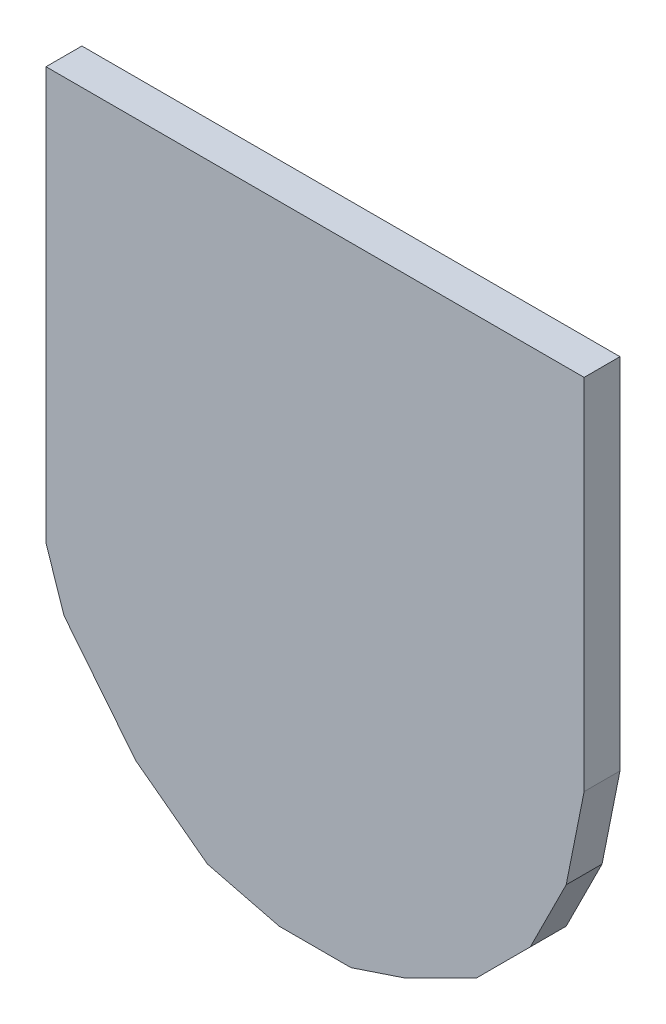
ISO-10303-21;
HEADER;
FILE_DESCRIPTION(('STEP AP214'),'2;1');
FILE_NAME('part.step','',(''),(''),'','','');
FILE_SCHEMA(('AUTOMOTIVE_DESIGN { 1 0 10303 214 1 1 1 1 }'));
ENDSEC;
DATA;
#1=APPLICATION_CONTEXT('core data for automotive mechanical design processes');
#2=APPLICATION_PROTOCOL_DEFINITION('international standard','automotive_design',2000,#1);
#3=PRODUCT_CONTEXT('',#1,'mechanical');
#4=PRODUCT('Part','Part','',(#3));
#5=PRODUCT_RELATED_PRODUCT_CATEGORY('part','',(#4));
#6=PRODUCT_DEFINITION_FORMATION('','',#4);
#7=PRODUCT_DEFINITION_CONTEXT('part definition',#1,'design');
#8=PRODUCT_DEFINITION('design','',#6,#7);
#9=PRODUCT_DEFINITION_SHAPE('','',#8);
#10=(LENGTH_UNIT() NAMED_UNIT(*) SI_UNIT(.MILLI.,.METRE.));
#11=(NAMED_UNIT(*) PLANE_ANGLE_UNIT() SI_UNIT($,.RADIAN.));
#12=(NAMED_UNIT(*) SI_UNIT($,.STERADIAN.) SOLID_ANGLE_UNIT());
#13=UNCERTAINTY_MEASURE_WITH_UNIT(LENGTH_MEASURE(1.E-05),#10,'distance_accuracy_value','');
#14=(GEOMETRIC_REPRESENTATION_CONTEXT(3) GLOBAL_UNCERTAINTY_ASSIGNED_CONTEXT((#13)) GLOBAL_UNIT_ASSIGNED_CONTEXT((#10,
#11,#12)) REPRESENTATION_CONTEXT('',''));
#15=CARTESIAN_POINT('',(0.,0.,0.));
#16=DIRECTION('',(0.,0.,1.));
#17=DIRECTION('',(1.,0.,0.));
#18=AXIS2_PLACEMENT_3D('',#15,#16,#17);
#19=CARTESIAN_POINT('',(0.1499997,0.17500092,0.02));
#20=DIRECTION('',(0.,0.,1.));
#21=DIRECTION('',(1.,0.,0.));
#22=AXIS2_PLACEMENT_3D('',#19,#20,#21);
#23=PLANE('',#22);
#24=DIRECTION('',(0.196068236745948,0.98059025415274,0.));
#25=VECTOR('',#24,1.);
#26=CARTESIAN_POINT('',(0.1499997,-0.02499868,0.02));
#27=LINE('',#26,#25);
#28=CARTESIAN_POINT('',(0.1499997,-0.0249986800000003,0.02));
#29=VERTEX_POINT('',#28);
#30=CARTESIAN_POINT('',(0.140002260000001,-0.0749985800000001,0.02));
#31=VERTEX_POINT('',#30);
#32=EDGE_CURVE('E218',#29,#31,#27,.F.);
#33=ORIENTED_EDGE('',*,*,#32,.F.);
#34=DIRECTION('',(0.,1.,0.));
#35=VECTOR('',#34,1.);
#36=CARTESIAN_POINT('',(0.1499997,0.17500092,0.02));
#37=LINE('',#36,#35);
#38=CARTESIAN_POINT('',(0.1499997,0.17500092,0.02));
#39=VERTEX_POINT('',#38);
#40=EDGE_CURVE('E156',#39,#29,#37,.F.);
#41=ORIENTED_EDGE('',*,*,#40,.F.);
#42=DIRECTION('',(1.,0.,0.));
#43=VECTOR('',#42,1.);
#44=CARTESIAN_POINT('',(-0.1499997,0.17500092,0.02));
#45=LINE('',#44,#43);
#46=CARTESIAN_POINT('',(-0.1499997,0.17500092,0.02));
#47=VERTEX_POINT('',#46);
#48=EDGE_CURVE('E132',#47,#39,#45,.T.);
#49=ORIENTED_EDGE('',*,*,#48,.F.);
#50=DIRECTION('',(0.,1.,0.));
#51=VECTOR('',#50,1.);
#52=CARTESIAN_POINT('',(-0.1499997,-0.02499868,0.02));
#53=LINE('',#52,#51);
#54=CARTESIAN_POINT('',(-0.149999699999994,-0.0249986800952127,0.02));
#55=VERTEX_POINT('',#54);
#56=EDGE_CURVE('E129',#55,#47,#53,.T.);
#57=ORIENTED_EDGE('',*,*,#56,.F.);
#58=DIRECTION('',(8.466683559677E-05,-0.999999996415764,0.));
#59=VECTOR('',#58,1.);
#60=CARTESIAN_POINT('',(-0.14999716,-0.05499861999999,0.02));
#61=LINE('',#60,#59);
#62=CARTESIAN_POINT('',(-0.149997160000005,-0.0549986200000074,0.02));
#63=VERTEX_POINT('',#62);
#64=EDGE_CURVE('E20',#63,#55,#61,.F.);
#65=ORIENTED_EDGE('',*,*,#64,.F.);
#66=DIRECTION('',(0.316227766017138,-0.948683298050414,0.));
#67=VECTOR('',#66,1.);
#68=CARTESIAN_POINT('',(-0.13999718,-0.08499855999999,0.02));
#69=LINE('',#68,#67);
#70=CARTESIAN_POINT('',(-0.139997180000001,-0.0849985599999537,0.02));
#71=VERTEX_POINT('',#70);
#72=EDGE_CURVE('E114',#71,#63,#69,.F.);
#73=ORIENTED_EDGE('',*,*,#72,.F.);
#74=DIRECTION('',(0.62469504755418,-0.780868809443225,0.));
#75=VECTOR('',#74,1.);
#76=CARTESIAN_POINT('',(-0.09999725999999,-0.13499846,0.02));
#77=LINE('',#76,#75);
#78=CARTESIAN_POINT('',(-0.0999972599999898,-0.13499846,0.02));
#79=VERTEX_POINT('',#78);
#80=EDGE_CURVE('E168',#79,#71,#77,.F.);
#81=ORIENTED_EDGE('',*,*,#80,.F.);
#82=DIRECTION('',(0.8,-0.6,0.));
#83=VECTOR('',#82,1.);
#84=CARTESIAN_POINT('',(-0.05999734,-0.1649984,0.02));
#85=LINE('',#84,#83);
#86=CARTESIAN_POINT('',(-0.0599973400000006,-0.164998400000002,0.02));
#87=VERTEX_POINT('',#86);
#88=EDGE_CURVE('E173',#87,#79,#85,.F.);
#89=ORIENTED_EDGE('',*,*,#88,.F.);
#90=DIRECTION('',(0.970142500145391,-0.242535625036098,0.));
#91=VECTOR('',#90,1.);
#92=CARTESIAN_POINT('',(-0.01999742,-0.17499838,0.02));
#93=LINE('',#92,#91);
#94=CARTESIAN_POINT('',(-0.01999742,-0.17499838,0.02));
#95=VERTEX_POINT('',#94);
#96=EDGE_CURVE('E179',#95,#87,#93,.F.);
#97=ORIENTED_EDGE('',*,*,#96,.F.);
#98=DIRECTION('',(1.,0.,0.));
#99=VECTOR('',#98,1.);
#100=CARTESIAN_POINT('',(0.0200025,-0.17499838,0.02));
#101=LINE('',#100,#99);
#102=CARTESIAN_POINT('',(0.020002500000001,-0.174998380000002,0.02));
#103=VERTEX_POINT('',#102);
#104=EDGE_CURVE('E198',#103,#95,#101,.F.);
#105=ORIENTED_EDGE('',*,*,#104,.F.);
#106=DIRECTION('',(0.948683298050414,0.316227766017138,0.));
#107=VECTOR('',#106,1.);
#108=CARTESIAN_POINT('',(0.05000244,-0.1649984,0.02));
#109=LINE('',#108,#107);
#110=CARTESIAN_POINT('',(0.0500024400000001,-0.1649984,0.02));
#111=VERTEX_POINT('',#110);
#112=EDGE_CURVE('E202',#111,#103,#109,.F.);
#113=ORIENTED_EDGE('',*,*,#112,.F.);
#114=DIRECTION('',(0.894427190999916,0.447213595499958,0.));
#115=VECTOR('',#114,1.);
#116=CARTESIAN_POINT('',(0.09000236,-0.14499844,0.02));
#117=LINE('',#116,#115);
#118=CARTESIAN_POINT('',(0.0900023599999947,-0.144998439999995,0.02));
#119=VERTEX_POINT('',#118);
#120=EDGE_CURVE('E206',#119,#111,#117,.F.);
#121=ORIENTED_EDGE('',*,*,#120,.F.);
#122=DIRECTION('',(0.707106781187048,0.707106781186048,0.));
#123=VECTOR('',#122,1.);
#124=CARTESIAN_POINT('',(0.1200023,-0.1149985,0.02));
#125=LINE('',#124,#123);
#126=CARTESIAN_POINT('',(0.1200023,-0.1149985,0.02));
#127=VERTEX_POINT('',#126);
#128=EDGE_CURVE('E210',#127,#119,#125,.F.);
#129=ORIENTED_EDGE('',*,*,#128,.F.);
#130=DIRECTION('',(0.447213595499958,0.894427190999916,0.));
#131=VECTOR('',#130,1.);
#132=CARTESIAN_POINT('',(0.14000226,-0.07499858,0.02));
#133=LINE('',#132,#131);
#134=EDGE_CURVE('E214',#31,#127,#133,.F.);
#135=ORIENTED_EDGE('',*,*,#134,.F.);
#136=EDGE_LOOP('',(#33,#41,#49,#57,#65,#73,#81,#89,#97,#105,#113,#121,#129,#135));
#137=FACE_BOUND('',#136,.T.);
#138=ADVANCED_FACE('F17',(#137),#23,.T.);
#139=CARTESIAN_POINT('',(-0.1499997,0.17500092,0.));
#140=DIRECTION('',(0.,1.,0.));
#141=DIRECTION('',(0.,0.,1.));
#142=AXIS2_PLACEMENT_3D('',#139,#140,#141);
#143=PLANE('',#142);
#144=DIRECTION('',(0.,0.,-1.));
#145=VECTOR('',#144,1.);
#146=CARTESIAN_POINT('',(0.1499997,0.17500092,0.));
#147=LINE('',#146,#145);
#148=CARTESIAN_POINT('',(0.1499997,0.17500092,0.));
#149=VERTEX_POINT('',#148);
#150=EDGE_CURVE('E153',#149,#39,#147,.F.);
#151=ORIENTED_EDGE('',*,*,#150,.F.);
#152=DIRECTION('',(1.,0.,0.));
#153=VECTOR('',#152,1.);
#154=CARTESIAN_POINT('',(0.1499997,0.17500092,0.));
#155=LINE('',#154,#153);
#156=CARTESIAN_POINT('',(-0.1499997,0.17500092,0.));
#157=VERTEX_POINT('',#156);
#158=EDGE_CURVE('E148',#149,#157,#155,.F.);
#159=ORIENTED_EDGE('',*,*,#158,.T.);
#160=DIRECTION('',(0.,0.,1.));
#161=VECTOR('',#160,1.);
#162=CARTESIAN_POINT('',(-0.1499997,0.17500092,0.));
#163=LINE('',#162,#161);
#164=EDGE_CURVE('E127',#47,#157,#163,.F.);
#165=ORIENTED_EDGE('',*,*,#164,.F.);
#166=ORIENTED_EDGE('',*,*,#48,.T.);
#167=EDGE_LOOP('',(#151,#159,#165,#166));
#168=FACE_BOUND('',#167,.T.);
#169=ADVANCED_FACE('F380',(#168),#143,.T.);
#170=CARTESIAN_POINT('',(-0.1499997,-0.02499868,0.));
#171=DIRECTION('',(-1.,0.,0.));
#172=DIRECTION('',(0.,0.,1.));
#173=AXIS2_PLACEMENT_3D('',#170,#171,#172);
#174=PLANE('',#173);
#175=ORIENTED_EDGE('',*,*,#164,.T.);
#176=DIRECTION('',(0.,1.,0.));
#177=VECTOR('',#176,1.);
#178=CARTESIAN_POINT('',(-0.1499997,0.17500092,0.));
#179=LINE('',#178,#177);
#180=CARTESIAN_POINT('',(-0.149999699999964,-0.0249986808041779,0.));
#181=VERTEX_POINT('',#180);
#182=EDGE_CURVE('E139',#157,#181,#179,.F.);
#183=ORIENTED_EDGE('',*,*,#182,.T.);
#184=DIRECTION('',(0.,0.,1.));
#185=VECTOR('',#184,1.);
#186=CARTESIAN_POINT('',(-0.149999699999997,-0.02499868,0.));
#187=LINE('',#186,#185);
#188=EDGE_CURVE('E123',#55,#181,#187,.F.);
#189=ORIENTED_EDGE('',*,*,#188,.F.);
#190=ORIENTED_EDGE('',*,*,#56,.T.);
#191=EDGE_LOOP('',(#175,#183,#189,#190));
#192=FACE_BOUND('',#191,.T.);
#193=ADVANCED_FACE('F137',(#192),#174,.T.);
#194=CARTESIAN_POINT('',(-0.14999716,-0.05499861999999,0.));
#195=DIRECTION('',(-0.999999996415764,-8.466683559677E-05,0.));
#196=DIRECTION('',(8.466683559677E-05,-0.999999996415764,0.));
#197=AXIS2_PLACEMENT_3D('',#194,#195,#196);
#198=PLANE('',#197);
#199=ORIENTED_EDGE('',*,*,#188,.T.);
#200=DIRECTION('',(8.466683559677E-05,-0.999999996415764,0.));
#201=VECTOR('',#200,1.);
#202=CARTESIAN_POINT('',(-0.14999716,-0.05499861999999,0.));
#203=LINE('',#202,#201);
#204=CARTESIAN_POINT('',(-0.149997160000005,-0.0549986200000074,0.));
#205=VERTEX_POINT('',#204);
#206=EDGE_CURVE('E188',#181,#205,#203,.T.);
#207=ORIENTED_EDGE('',*,*,#206,.T.);
#208=DIRECTION('',(0.,0.,1.));
#209=VECTOR('',#208,1.);
#210=CARTESIAN_POINT('',(-0.149997160000009,-0.0549986199999932,0.));
#211=LINE('',#210,#209);
#212=EDGE_CURVE('E125',#63,#205,#211,.F.);
#213=ORIENTED_EDGE('',*,*,#212,.F.);
#214=ORIENTED_EDGE('',*,*,#64,.T.);
#215=EDGE_LOOP('',(#199,#207,#213,#214));
#216=FACE_BOUND('',#215,.T.);
#217=ADVANCED_FACE('F120',(#216),#198,.T.);
#218=CARTESIAN_POINT('',(-0.13999718,-0.08499855999999,0.));
#219=DIRECTION('',(-0.948683298050414,-0.316227766017138,0.));
#220=DIRECTION('',(0.316227766017138,-0.948683298050414,0.));
#221=AXIS2_PLACEMENT_3D('',#218,#219,#220);
#222=PLANE('',#221);
#223=ORIENTED_EDGE('',*,*,#212,.T.);
#224=DIRECTION('',(0.316227766017138,-0.948683298050414,0.));
#225=VECTOR('',#224,1.);
#226=CARTESIAN_POINT('',(-0.13999718,-0.08499855999999,0.));
#227=LINE('',#226,#225);
#228=CARTESIAN_POINT('',(-0.139997179999996,-0.0849985599999848,0.));
#229=VERTEX_POINT('',#228);
#230=EDGE_CURVE('E184',#205,#229,#227,.T.);
#231=ORIENTED_EDGE('',*,*,#230,.T.);
#232=DIRECTION('',(0.,0.,1.));
#233=VECTOR('',#232,1.);
#234=CARTESIAN_POINT('',(-0.139997179999983,-0.0849985599999765,0.));
#235=LINE('',#234,#233);
#236=EDGE_CURVE('E170',#71,#229,#235,.F.);
#237=ORIENTED_EDGE('',*,*,#236,.F.);
#238=ORIENTED_EDGE('',*,*,#72,.T.);
#239=EDGE_LOOP('',(#223,#231,#237,#238));
#240=FACE_BOUND('',#239,.T.);
#241=ADVANCED_FACE('F289',(#240),#222,.T.);
#242=CARTESIAN_POINT('',(-0.09999725999999,-0.13499846,0.));
#243=DIRECTION('',(-0.780868809443225,-0.62469504755418,0.));
#244=DIRECTION('',(0.62469504755418,-0.780868809443225,0.));
#245=AXIS2_PLACEMENT_3D('',#242,#243,#244);
#246=PLANE('',#245);
#247=ORIENTED_EDGE('',*,*,#236,.T.);
#248=DIRECTION('',(0.624695047554443,-0.780868809443016,0.));
#249=VECTOR('',#248,1.);
#250=CARTESIAN_POINT('',(-0.13999718,-0.08499855999999,0.));
#251=LINE('',#250,#249);
#252=CARTESIAN_POINT('',(-0.0999972599999909,-0.134998460000001,0.));
#253=VERTEX_POINT('',#252);
#254=EDGE_CURVE('E187',#229,#253,#251,.T.);
#255=ORIENTED_EDGE('',*,*,#254,.T.);
#256=DIRECTION('',(0.,0.,1.));
#257=VECTOR('',#256,1.);
#258=CARTESIAN_POINT('',(-0.0999972599999936,-0.134998460000005,0.));
#259=LINE('',#258,#257);
#260=EDGE_CURVE('E175',#79,#253,#259,.F.);
#261=ORIENTED_EDGE('',*,*,#260,.F.);
#262=ORIENTED_EDGE('',*,*,#80,.T.);
#263=EDGE_LOOP('',(#247,#255,#261,#262));
#264=FACE_BOUND('',#263,.T.);
#265=ADVANCED_FACE('F287',(#264),#246,.T.);
#266=CARTESIAN_POINT('',(-0.05999734,-0.1649984,0.));
#267=DIRECTION('',(-0.6,-0.8,0.));
#268=DIRECTION('',(0.8,-0.6,0.));
#269=AXIS2_PLACEMENT_3D('',#266,#267,#268);
#270=PLANE('',#269);
#271=ORIENTED_EDGE('',*,*,#260,.T.);
#272=DIRECTION('',(0.799999999999928,-0.600000000000096,0.));
#273=VECTOR('',#272,1.);
#274=CARTESIAN_POINT('',(-0.09999725999999,-0.13499846,0.));
#275=LINE('',#274,#273);
#276=CARTESIAN_POINT('',(-0.0599973400000006,-0.164998400000002,0.));
#277=VERTEX_POINT('',#276);
#278=EDGE_CURVE('E193',#253,#277,#275,.T.);
#279=ORIENTED_EDGE('',*,*,#278,.T.);
#280=DIRECTION('',(0.,0.,1.));
#281=VECTOR('',#280,1.);
#282=CARTESIAN_POINT('',(-0.0599973400000025,-0.16499840000001,0.));
#283=LINE('',#282,#281);
#284=EDGE_CURVE('E196',#87,#277,#283,.F.);
#285=ORIENTED_EDGE('',*,*,#284,.F.);
#286=ORIENTED_EDGE('',*,*,#88,.T.);
#287=EDGE_LOOP('',(#271,#279,#285,#286));
#288=FACE_BOUND('',#287,.T.);
#289=ADVANCED_FACE('F283',(#288),#270,.T.);
#290=CARTESIAN_POINT('',(-0.01999742,-0.17499838,0.));
#291=DIRECTION('',(-0.242535625036098,-0.970142500145391,0.));
#292=DIRECTION('',(0.970142500145391,-0.242535625036098,0.));
#293=AXIS2_PLACEMENT_3D('',#290,#291,#292);
#294=PLANE('',#293);
#295=ORIENTED_EDGE('',*,*,#284,.T.);
#296=DIRECTION('',(0.970142500145332,-0.242535625036333,0.));
#297=VECTOR('',#296,1.);
#298=CARTESIAN_POINT('',(-0.05999734,-0.1649984,0.));
#299=LINE('',#298,#297);
#300=CARTESIAN_POINT('',(-0.01999742,-0.17499838,0.));
#301=VERTEX_POINT('',#300);
#302=EDGE_CURVE('E224',#277,#301,#299,.T.);
#303=ORIENTED_EDGE('',*,*,#302,.T.);
#304=DIRECTION('',(0.,0.,-1.));
#305=VECTOR('',#304,1.);
#306=CARTESIAN_POINT('',(-0.01999742,-0.17499838,0.));
#307=LINE('',#306,#305);
#308=EDGE_CURVE('E200',#95,#301,#307,.T.);
#309=ORIENTED_EDGE('',*,*,#308,.F.);
#310=ORIENTED_EDGE('',*,*,#96,.T.);
#311=EDGE_LOOP('',(#295,#303,#309,#310));
#312=FACE_BOUND('',#311,.T.);
#313=ADVANCED_FACE('F277',(#312),#294,.T.);
#314=CARTESIAN_POINT('',(0.0200025,-0.17499838,0.));
#315=DIRECTION('',(0.,-1.,0.));
#316=DIRECTION('',(0.,0.,-1.));
#317=AXIS2_PLACEMENT_3D('',#314,#315,#316);
#318=PLANE('',#317);
#319=ORIENTED_EDGE('',*,*,#308,.T.);
#320=DIRECTION('',(1.,0.,0.));
#321=VECTOR('',#320,1.);
#322=CARTESIAN_POINT('',(0.1499997,-0.17499838,0.));
#323=LINE('',#322,#321);
#324=CARTESIAN_POINT('',(0.0200025000000009,-0.174998380000002,0.));
#325=VERTEX_POINT('',#324);
#326=EDGE_CURVE('E227',#301,#325,#323,.T.);
#327=ORIENTED_EDGE('',*,*,#326,.T.);
#328=DIRECTION('',(0.,0.,1.));
#329=VECTOR('',#328,1.);
#330=CARTESIAN_POINT('',(0.0200025000000031,-0.174998380000009,0.));
#331=LINE('',#330,#329);
#332=EDGE_CURVE('E204',#103,#325,#331,.F.);
#333=ORIENTED_EDGE('',*,*,#332,.F.);
#334=ORIENTED_EDGE('',*,*,#104,.T.);
#335=EDGE_LOOP('',(#319,#327,#333,#334));
#336=FACE_BOUND('',#335,.T.);
#337=ADVANCED_FACE('F273',(#336),#318,.T.);
#338=CARTESIAN_POINT('',(0.05000244,-0.1649984,0.));
#339=DIRECTION('',(0.316227766017138,-0.948683298050414,0.));
#340=DIRECTION('',(0.948683298050414,0.316227766017138,0.));
#341=AXIS2_PLACEMENT_3D('',#338,#339,#340);
#342=PLANE('',#341);
#343=ORIENTED_EDGE('',*,*,#332,.T.);
#344=DIRECTION('',(0.948683298050514,0.316227766016838,0.));
#345=VECTOR('',#344,1.);
#346=CARTESIAN_POINT('',(0.0200025,-0.17499838,0.));
#347=LINE('',#346,#345);
#348=CARTESIAN_POINT('',(0.05000244,-0.1649984,0.));
#349=VERTEX_POINT('',#348);
#350=EDGE_CURVE('E230',#325,#349,#347,.T.);
#351=ORIENTED_EDGE('',*,*,#350,.T.);
#352=DIRECTION('',(0.,0.,1.));
#353=VECTOR('',#352,1.);
#354=CARTESIAN_POINT('',(0.05000244,-0.1649984,0.));
#355=LINE('',#354,#353);
#356=EDGE_CURVE('E208',#111,#349,#355,.F.);
#357=ORIENTED_EDGE('',*,*,#356,.F.);
#358=ORIENTED_EDGE('',*,*,#112,.T.);
#359=EDGE_LOOP('',(#343,#351,#357,#358));
#360=FACE_BOUND('',#359,.T.);
#361=ADVANCED_FACE('F267',(#360),#342,.T.);
#362=CARTESIAN_POINT('',(0.09000236,-0.14499844,0.));
#363=DIRECTION('',(0.447213595499958,-0.894427190999916,0.));
#364=DIRECTION('',(0.894427190999916,0.447213595499958,0.));
#365=AXIS2_PLACEMENT_3D('',#362,#363,#364);
#366=PLANE('',#365);
#367=ORIENTED_EDGE('',*,*,#356,.T.);
#368=DIRECTION('',(0.894427190999916,0.447213595499958,0.));
#369=VECTOR('',#368,1.);
#370=CARTESIAN_POINT('',(0.05000244,-0.1649984,0.));
#371=LINE('',#370,#369);
#372=CARTESIAN_POINT('',(0.0900023599999947,-0.144998439999995,0.));
#373=VERTEX_POINT('',#372);
#374=EDGE_CURVE('E233',#349,#373,#371,.T.);
#375=ORIENTED_EDGE('',*,*,#374,.T.);
#376=DIRECTION('',(0.,0.,1.));
#377=VECTOR('',#376,1.);
#378=CARTESIAN_POINT('',(0.0900023599999788,-0.144998439999979,0.));
#379=LINE('',#378,#377);
#380=EDGE_CURVE('E212',#119,#373,#379,.F.);
#381=ORIENTED_EDGE('',*,*,#380,.F.);
#382=ORIENTED_EDGE('',*,*,#120,.T.);
#383=EDGE_LOOP('',(#367,#375,#381,#382));
#384=FACE_BOUND('',#383,.T.);
#385=ADVANCED_FACE('F263',(#384),#366,.T.);
#386=CARTESIAN_POINT('',(0.1200023,-0.1149985,0.));
#387=DIRECTION('',(0.707106781186048,-0.707106781187048,0.));
#388=DIRECTION('',(0.707106781187048,0.707106781186048,0.));
#389=AXIS2_PLACEMENT_3D('',#386,#387,#388);
#390=PLANE('',#389);
#391=ORIENTED_EDGE('',*,*,#380,.T.);
#392=DIRECTION('',(0.707106781186548,0.707106781186547,0.));
#393=VECTOR('',#392,1.);
#394=CARTESIAN_POINT('',(0.09000236,-0.14499844,0.));
#395=LINE('',#394,#393);
#396=CARTESIAN_POINT('',(0.1200023,-0.1149985,0.));
#397=VERTEX_POINT('',#396);
#398=EDGE_CURVE('E236',#373,#397,#395,.T.);
#399=ORIENTED_EDGE('',*,*,#398,.T.);
#400=DIRECTION('',(0.,0.,1.));
#401=VECTOR('',#400,1.);
#402=CARTESIAN_POINT('',(0.1200023,-0.1149985,0.));
#403=LINE('',#402,#401);
#404=EDGE_CURVE('E216',#127,#397,#403,.F.);
#405=ORIENTED_EDGE('',*,*,#404,.F.);
#406=ORIENTED_EDGE('',*,*,#128,.T.);
#407=EDGE_LOOP('',(#391,#399,#405,#406));
#408=FACE_BOUND('',#407,.T.);
#409=ADVANCED_FACE('F257',(#408),#390,.T.);
#410=CARTESIAN_POINT('',(0.14000226,-0.07499858,0.));
#411=DIRECTION('',(0.894427190999916,-0.447213595499958,0.));
#412=DIRECTION('',(0.447213595499958,0.894427190999916,0.));
#413=AXIS2_PLACEMENT_3D('',#410,#411,#412);
#414=PLANE('',#413);
#415=ORIENTED_EDGE('',*,*,#404,.T.);
#416=DIRECTION('',(0.447213595499957,0.894427190999916,0.));
#417=VECTOR('',#416,1.);
#418=CARTESIAN_POINT('',(0.1200023,-0.1149985,0.));
#419=LINE('',#418,#417);
#420=CARTESIAN_POINT('',(0.140002260000001,-0.0749985800000001,0.));
#421=VERTEX_POINT('',#420);
#422=EDGE_CURVE('E239',#397,#421,#419,.T.);
#423=ORIENTED_EDGE('',*,*,#422,.T.);
#424=DIRECTION('',(0.,0.,1.));
#425=VECTOR('',#424,1.);
#426=CARTESIAN_POINT('',(0.140002260000003,-0.0749985800000006,0.));
#427=LINE('',#426,#425);
#428=EDGE_CURVE('E157',#31,#421,#427,.F.);
#429=ORIENTED_EDGE('',*,*,#428,.F.);
#430=ORIENTED_EDGE('',*,*,#134,.T.);
#431=EDGE_LOOP('',(#415,#423,#429,#430));
#432=FACE_BOUND('',#431,.T.);
#433=ADVANCED_FACE('F252',(#432),#414,.T.);
#434=CARTESIAN_POINT('',(0.1499997,-0.02499868,0.));
#435=DIRECTION('',(0.98059025415274,-0.196068236745948,0.));
#436=DIRECTION('',(0.196068236745948,0.98059025415274,0.));
#437=AXIS2_PLACEMENT_3D('',#434,#435,#436);
#438=PLANE('',#437);
#439=ORIENTED_EDGE('',*,*,#428,.T.);
#440=DIRECTION('',(0.196068236746007,0.980590254152728,0.));
#441=VECTOR('',#440,1.);
#442=CARTESIAN_POINT('',(0.14000226,-0.07499858,0.));
#443=LINE('',#442,#441);
#444=CARTESIAN_POINT('',(0.1499997,-0.0249986800000001,0.));
#445=VERTEX_POINT('',#444);
#446=EDGE_CURVE('E26',#421,#445,#443,.T.);
#447=ORIENTED_EDGE('',*,*,#446,.T.);
#448=DIRECTION('',(0.,0.,-1.));
#449=VECTOR('',#448,1.);
#450=CARTESIAN_POINT('',(0.1499997,-0.02499868,0.));
#451=LINE('',#450,#449);
#452=EDGE_CURVE('E34',#29,#445,#451,.T.);
#453=ORIENTED_EDGE('',*,*,#452,.F.);
#454=ORIENTED_EDGE('',*,*,#32,.T.);
#455=EDGE_LOOP('',(#439,#447,#453,#454));
#456=FACE_BOUND('',#455,.T.);
#457=ADVANCED_FACE('F245',(#456),#438,.T.);
#458=CARTESIAN_POINT('',(0.1499997,0.17500092,0.));
#459=DIRECTION('',(1.,0.,0.));
#460=DIRECTION('',(0.,0.,-1.));
#461=AXIS2_PLACEMENT_3D('',#458,#459,#460);
#462=PLANE('',#461);
#463=ORIENTED_EDGE('',*,*,#452,.T.);
#464=DIRECTION('',(0.,1.,0.));
#465=VECTOR('',#464,1.);
#466=CARTESIAN_POINT('',(0.1499997,0.17500092,0.));
#467=LINE('',#466,#465);
#468=EDGE_CURVE('E11',#445,#149,#467,.T.);
#469=ORIENTED_EDGE('',*,*,#468,.T.);
#470=ORIENTED_EDGE('',*,*,#150,.T.);
#471=ORIENTED_EDGE('',*,*,#40,.T.);
#472=EDGE_LOOP('',(#463,#469,#470,#471));
#473=FACE_BOUND('',#472,.T.);
#474=ADVANCED_FACE('F300',(#473),#462,.T.);
#475=CARTESIAN_POINT('',(0.1499997,0.17500092,0.));
#476=DIRECTION('',(0.,0.,1.));
#477=DIRECTION('',(1.,0.,0.));
#478=AXIS2_PLACEMENT_3D('',#475,#476,#477);
#479=PLANE('',#478);
#480=ORIENTED_EDGE('',*,*,#446,.F.);
#481=ORIENTED_EDGE('',*,*,#422,.F.);
#482=ORIENTED_EDGE('',*,*,#398,.F.);
#483=ORIENTED_EDGE('',*,*,#374,.F.);
#484=ORIENTED_EDGE('',*,*,#350,.F.);
#485=ORIENTED_EDGE('',*,*,#326,.F.);
#486=ORIENTED_EDGE('',*,*,#302,.F.);
#487=ORIENTED_EDGE('',*,*,#278,.F.);
#488=ORIENTED_EDGE('',*,*,#254,.F.);
#489=ORIENTED_EDGE('',*,*,#230,.F.);
#490=ORIENTED_EDGE('',*,*,#206,.F.);
#491=ORIENTED_EDGE('',*,*,#182,.F.);
#492=ORIENTED_EDGE('',*,*,#158,.F.);
#493=ORIENTED_EDGE('',*,*,#468,.F.);
#494=EDGE_LOOP('',(#480,#481,#482,#483,#484,#485,#486,#487,#488,#489,#490,#491,#492,#493));
#495=FACE_BOUND('',#494,.T.);
#496=ADVANCED_FACE('F249',(#495),#479,.F.);
#497=CLOSED_SHELL('',(#138,#169,#193,#217,#241,#265,#289,#313,#337,#361,#385,#409,#433,#457,
#474,#496));
#498=MANIFOLD_SOLID_BREP('B1',#497);
#499=ADVANCED_BREP_SHAPE_REPRESENTATION('',(#18,#498),#14);
#500=SHAPE_DEFINITION_REPRESENTATION(#9,#499);
ENDSEC;
END-ISO-10303-21;
